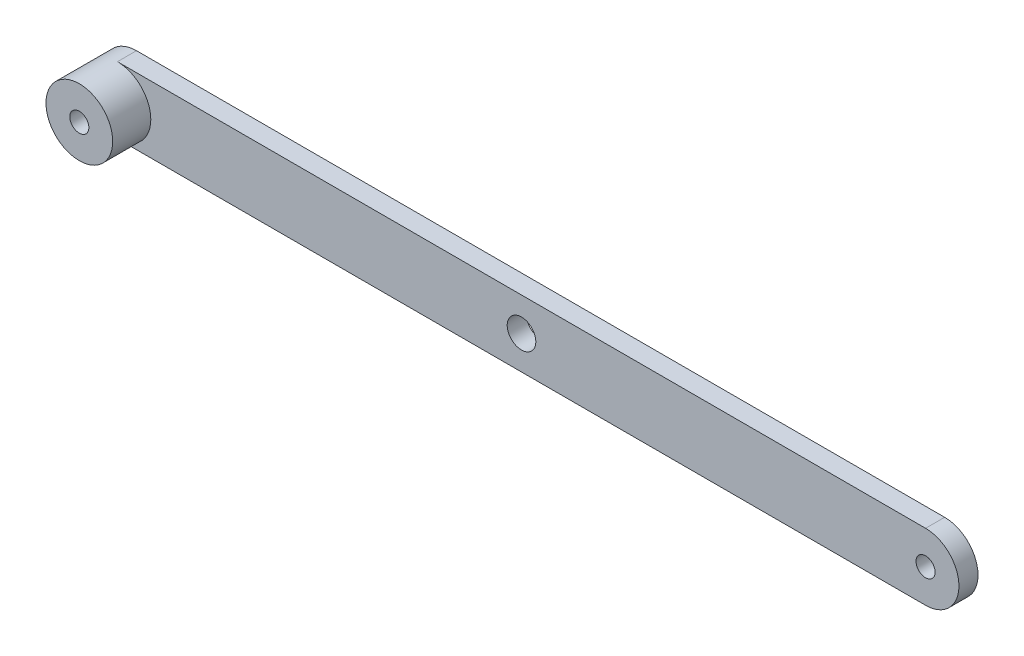
ISO-10303-21;
HEADER;
FILE_DESCRIPTION(('STEP AP214'),'2;1');
FILE_NAME('part.step','',(''),(''),'','','');
FILE_SCHEMA(('AUTOMOTIVE_DESIGN { 1 0 10303 214 1 1 1 1 }'));
ENDSEC;
DATA;
#1=APPLICATION_CONTEXT('core data for automotive mechanical design processes');
#2=APPLICATION_PROTOCOL_DEFINITION('international standard','automotive_design',2000,#1);
#3=PRODUCT_CONTEXT('',#1,'mechanical');
#4=PRODUCT('Part','Part','',(#3));
#5=PRODUCT_RELATED_PRODUCT_CATEGORY('part','',(#4));
#6=PRODUCT_DEFINITION_FORMATION('','',#4);
#7=PRODUCT_DEFINITION_CONTEXT('part definition',#1,'design');
#8=PRODUCT_DEFINITION('design','',#6,#7);
#9=PRODUCT_DEFINITION_SHAPE('','',#8);
#10=(LENGTH_UNIT() NAMED_UNIT(*) SI_UNIT(.MILLI.,.METRE.));
#11=(NAMED_UNIT(*) PLANE_ANGLE_UNIT() SI_UNIT($,.RADIAN.));
#12=(NAMED_UNIT(*) SI_UNIT($,.STERADIAN.) SOLID_ANGLE_UNIT());
#13=UNCERTAINTY_MEASURE_WITH_UNIT(LENGTH_MEASURE(1.E-05),#10,'distance_accuracy_value','');
#14=(GEOMETRIC_REPRESENTATION_CONTEXT(3) GLOBAL_UNCERTAINTY_ASSIGNED_CONTEXT((#13)) GLOBAL_UNIT_ASSIGNED_CONTEXT((#10,
#11,#12)) REPRESENTATION_CONTEXT('',''));
#15=CARTESIAN_POINT('',(0.,0.,0.));
#16=DIRECTION('',(0.,0.,1.));
#17=DIRECTION('',(1.,0.,0.));
#18=AXIS2_PLACEMENT_3D('',#15,#16,#17);
#19=CARTESIAN_POINT('',(-212.,0.,10.));
#20=DIRECTION('',(0.,0.,1.));
#21=DIRECTION('',(1.,0.,0.));
#22=AXIS2_PLACEMENT_3D('',#19,#20,#21);
#23=PLANE('',#22);
#24=CARTESIAN_POINT('',(-212.,0.,10.));
#25=DIRECTION('',(0.,0.,1.));
#26=DIRECTION('',(1.,0.,0.));
#27=AXIS2_PLACEMENT_3D('',#24,#25,#26);
#28=CIRCLE('',#27,17.5);
#29=CARTESIAN_POINT('',(-212.,-17.5,10.));
#30=VERTEX_POINT('',#29);
#31=CARTESIAN_POINT('',(-212.,17.5,10.));
#32=VERTEX_POINT('',#31);
#33=EDGE_CURVE('E11',#30,#32,#28,.T.);
#34=ORIENTED_EDGE('',*,*,#33,.F.);
#35=DIRECTION('',(1.,0.,0.));
#36=VECTOR('',#35,1.);
#37=CARTESIAN_POINT('',(-212.,-17.5,10.));
#38=LINE('',#37,#36);
#39=CARTESIAN_POINT('',(212.,-17.5,10.));
#40=VERTEX_POINT('',#39);
#41=EDGE_CURVE('E113',#30,#40,#38,.T.);
#42=ORIENTED_EDGE('',*,*,#41,.T.);
#43=CARTESIAN_POINT('',(212.,0.,10.));
#44=DIRECTION('',(0.,0.,1.));
#45=DIRECTION('',(1.,0.,0.));
#46=AXIS2_PLACEMENT_3D('',#43,#44,#45);
#47=CIRCLE('',#46,17.5);
#48=CARTESIAN_POINT('',(212.,17.5,10.));
#49=VERTEX_POINT('',#48);
#50=EDGE_CURVE('E58',#40,#49,#47,.T.);
#51=ORIENTED_EDGE('',*,*,#50,.T.);
#52=DIRECTION('',(-1.,0.,0.));
#53=VECTOR('',#52,1.);
#54=CARTESIAN_POINT('',(-212.,17.5,10.));
#55=LINE('',#54,#53);
#56=EDGE_CURVE('E89',#49,#32,#55,.T.);
#57=ORIENTED_EDGE('',*,*,#56,.T.);
#58=EDGE_LOOP('',(#34,#42,#51,#57));
#59=FACE_BOUND('',#58,.T.);
#60=CARTESIAN_POINT('',(212.,0.,10.));
#61=DIRECTION('',(0.,0.,1.));
#62=DIRECTION('',(1.,0.,0.));
#63=AXIS2_PLACEMENT_3D('',#60,#61,#62);
#64=CIRCLE('',#63,5.00000000000002);
#65=CARTESIAN_POINT('',(217.,0.,10.));
#66=VERTEX_POINT('',#65);
#67=EDGE_CURVE('E129',#66,#66,#64,.T.);
#68=ORIENTED_EDGE('',*,*,#67,.F.);
#69=EDGE_LOOP('',(#68));
#70=FACE_BOUND('',#69,.T.);
#71=CARTESIAN_POINT('',(0.,0.,10.));
#72=DIRECTION('',(0.,0.,1.));
#73=DIRECTION('',(1.,0.,0.));
#74=AXIS2_PLACEMENT_3D('',#71,#72,#73);
#75=CIRCLE('',#74,7.5);
#76=CARTESIAN_POINT('',(7.5,0.,10.));
#77=VERTEX_POINT('',#76);
#78=EDGE_CURVE('E134',#77,#77,#75,.T.);
#79=ORIENTED_EDGE('',*,*,#78,.F.);
#80=EDGE_LOOP('',(#79));
#81=FACE_BOUND('',#80,.T.);
#82=ADVANCED_FACE('F39',(#59,#70,#81),#23,.T.);
#83=CARTESIAN_POINT('',(-212.,0.,0.));
#84=DIRECTION('',(0.,0.,1.));
#85=DIRECTION('',(1.,0.,0.));
#86=AXIS2_PLACEMENT_3D('',#83,#84,#85);
#87=PLANE('',#86);
#88=CARTESIAN_POINT('',(-212.,0.,0.));
#89=DIRECTION('',(0.,0.,1.));
#90=DIRECTION('',(1.,0.,0.));
#91=AXIS2_PLACEMENT_3D('',#88,#89,#90);
#92=CIRCLE('',#91,17.5);
#93=CARTESIAN_POINT('',(-212.,17.5,0.));
#94=VERTEX_POINT('',#93);
#95=CARTESIAN_POINT('',(-212.,-17.5,0.));
#96=VERTEX_POINT('',#95);
#97=EDGE_CURVE('E102',#94,#96,#92,.T.);
#98=ORIENTED_EDGE('',*,*,#97,.F.);
#99=DIRECTION('',(-1.,0.,0.));
#100=VECTOR('',#99,1.);
#101=CARTESIAN_POINT('',(-212.,17.5,0.));
#102=LINE('',#101,#100);
#103=CARTESIAN_POINT('',(212.,17.5,0.));
#104=VERTEX_POINT('',#103);
#105=EDGE_CURVE('E81',#104,#94,#102,.T.);
#106=ORIENTED_EDGE('',*,*,#105,.F.);
#107=CARTESIAN_POINT('',(212.,0.,0.));
#108=DIRECTION('',(0.,0.,1.));
#109=DIRECTION('',(1.,0.,0.));
#110=AXIS2_PLACEMENT_3D('',#107,#108,#109);
#111=CIRCLE('',#110,17.5);
#112=CARTESIAN_POINT('',(212.,-17.5,0.));
#113=VERTEX_POINT('',#112);
#114=EDGE_CURVE('E75',#113,#104,#111,.T.);
#115=ORIENTED_EDGE('',*,*,#114,.F.);
#116=DIRECTION('',(1.,0.,0.));
#117=VECTOR('',#116,1.);
#118=CARTESIAN_POINT('',(-212.,-17.5,0.));
#119=LINE('',#118,#117);
#120=EDGE_CURVE('E116',#96,#113,#119,.T.);
#121=ORIENTED_EDGE('',*,*,#120,.F.);
#122=EDGE_LOOP('',(#98,#106,#115,#121));
#123=FACE_BOUND('',#122,.T.);
#124=CARTESIAN_POINT('',(-212.,0.,0.));
#125=DIRECTION('',(0.,0.,1.));
#126=DIRECTION('',(1.,0.,0.));
#127=AXIS2_PLACEMENT_3D('',#124,#125,#126);
#128=CIRCLE('',#127,5.00000000000002);
#129=CARTESIAN_POINT('',(-207.,0.,0.));
#130=VERTEX_POINT('',#129);
#131=EDGE_CURVE('E120',#130,#130,#128,.T.);
#132=ORIENTED_EDGE('',*,*,#131,.T.);
#133=EDGE_LOOP('',(#132));
#134=FACE_BOUND('',#133,.T.);
#135=CARTESIAN_POINT('',(212.,0.,0.));
#136=DIRECTION('',(0.,0.,1.));
#137=DIRECTION('',(1.,0.,0.));
#138=AXIS2_PLACEMENT_3D('',#135,#136,#137);
#139=CIRCLE('',#138,5.00000000000002);
#140=CARTESIAN_POINT('',(217.,0.,0.));
#141=VERTEX_POINT('',#140);
#142=EDGE_CURVE('E130',#141,#141,#139,.T.);
#143=ORIENTED_EDGE('',*,*,#142,.T.);
#144=EDGE_LOOP('',(#143));
#145=FACE_BOUND('',#144,.T.);
#146=CARTESIAN_POINT('',(0.,0.,0.));
#147=DIRECTION('',(0.,0.,1.));
#148=DIRECTION('',(1.,0.,0.));
#149=AXIS2_PLACEMENT_3D('',#146,#147,#148);
#150=CIRCLE('',#149,7.5);
#151=CARTESIAN_POINT('',(7.5,0.,0.));
#152=VERTEX_POINT('',#151);
#153=EDGE_CURVE('E138',#152,#152,#150,.T.);
#154=ORIENTED_EDGE('',*,*,#153,.T.);
#155=EDGE_LOOP('',(#154));
#156=FACE_BOUND('',#155,.T.);
#157=ADVANCED_FACE('F168',(#123,#134,#145,#156),#87,.F.);
#158=CARTESIAN_POINT('',(-212.,0.,10.));
#159=DIRECTION('',(0.,0.,-1.));
#160=DIRECTION('',(-1.,0.,0.));
#161=AXIS2_PLACEMENT_3D('',#158,#159,#160);
#162=CYLINDRICAL_SURFACE('',#161,17.5);
#163=ORIENTED_EDGE('',*,*,#97,.T.);
#164=DIRECTION('',(0.,0.,-1.));
#165=VECTOR('',#164,1.);
#166=CARTESIAN_POINT('',(-212.,-17.5,10.));
#167=LINE('',#166,#165);
#168=EDGE_CURVE('E43',#30,#96,#167,.T.);
#169=ORIENTED_EDGE('',*,*,#168,.F.);
#170=ORIENTED_EDGE('',*,*,#33,.T.);
#171=DIRECTION('',(0.,0.,-1.));
#172=VECTOR('',#171,1.);
#173=CARTESIAN_POINT('',(-212.,17.5,10.));
#174=LINE('',#173,#172);
#175=EDGE_CURVE('E87',#32,#94,#174,.T.);
#176=ORIENTED_EDGE('',*,*,#175,.T.);
#177=EDGE_LOOP('',(#163,#169,#170,#176));
#178=FACE_BOUND('',#177,.T.);
#179=CARTESIAN_POINT('',(-212.,0.,30.));
#180=DIRECTION('',(0.,0.,1.));
#181=DIRECTION('',(1.,0.,0.));
#182=AXIS2_PLACEMENT_3D('',#179,#180,#181);
#183=CIRCLE('',#182,17.5);
#184=CARTESIAN_POINT('',(-194.5,0.,30.));
#185=VERTEX_POINT('',#184);
#186=EDGE_CURVE('E142',#185,#185,#183,.T.);
#187=ORIENTED_EDGE('',*,*,#186,.F.);
#188=EDGE_LOOP('',(#187));
#189=FACE_BOUND('',#188,.T.);
#190=ADVANCED_FACE('F41',(#178,#189),#162,.T.);
#191=CARTESIAN_POINT('',(-212.,-17.5,10.));
#192=DIRECTION('',(0.,1.,0.));
#193=DIRECTION('',(0.,0.,1.));
#194=AXIS2_PLACEMENT_3D('',#191,#192,#193);
#195=PLANE('',#194);
#196=ORIENTED_EDGE('',*,*,#120,.T.);
#197=DIRECTION('',(0.,0.,-1.));
#198=VECTOR('',#197,1.);
#199=CARTESIAN_POINT('',(212.,-17.5,10.));
#200=LINE('',#199,#198);
#201=EDGE_CURVE('E105',#40,#113,#200,.T.);
#202=ORIENTED_EDGE('',*,*,#201,.F.);
#203=ORIENTED_EDGE('',*,*,#41,.F.);
#204=ORIENTED_EDGE('',*,*,#168,.T.);
#205=EDGE_LOOP('',(#196,#202,#203,#204));
#206=FACE_BOUND('',#205,.T.);
#207=ADVANCED_FACE('F182',(#206),#195,.F.);
#208=CARTESIAN_POINT('',(212.,0.,10.));
#209=DIRECTION('',(0.,0.,-1.));
#210=DIRECTION('',(-1.,0.,0.));
#211=AXIS2_PLACEMENT_3D('',#208,#209,#210);
#212=CYLINDRICAL_SURFACE('',#211,17.5);
#213=ORIENTED_EDGE('',*,*,#114,.T.);
#214=DIRECTION('',(0.,0.,-1.));
#215=VECTOR('',#214,1.);
#216=CARTESIAN_POINT('',(212.,17.5,10.));
#217=LINE('',#216,#215);
#218=EDGE_CURVE('E94',#49,#104,#217,.T.);
#219=ORIENTED_EDGE('',*,*,#218,.F.);
#220=ORIENTED_EDGE('',*,*,#50,.F.);
#221=ORIENTED_EDGE('',*,*,#201,.T.);
#222=EDGE_LOOP('',(#213,#219,#220,#221));
#223=FACE_BOUND('',#222,.T.);
#224=ADVANCED_FACE('F180',(#223),#212,.T.);
#225=CARTESIAN_POINT('',(-212.,17.5,10.));
#226=DIRECTION('',(0.,-1.,0.));
#227=DIRECTION('',(0.,0.,-1.));
#228=AXIS2_PLACEMENT_3D('',#225,#226,#227);
#229=PLANE('',#228);
#230=ORIENTED_EDGE('',*,*,#105,.T.);
#231=ORIENTED_EDGE('',*,*,#175,.F.);
#232=ORIENTED_EDGE('',*,*,#56,.F.);
#233=ORIENTED_EDGE('',*,*,#218,.T.);
#234=EDGE_LOOP('',(#230,#231,#232,#233));
#235=FACE_BOUND('',#234,.T.);
#236=ADVANCED_FACE('F88',(#235),#229,.F.);
#237=CARTESIAN_POINT('',(-212.,0.,10.));
#238=DIRECTION('',(0.,0.,-1.));
#239=DIRECTION('',(-1.,0.,0.));
#240=AXIS2_PLACEMENT_3D('',#237,#238,#239);
#241=CYLINDRICAL_SURFACE('',#240,5.00000000000002);
#242=ORIENTED_EDGE('',*,*,#131,.F.);
#243=EDGE_LOOP('',(#242));
#244=FACE_BOUND('',#243,.T.);
#245=CARTESIAN_POINT('',(-212.,0.,30.));
#246=DIRECTION('',(0.,0.,1.));
#247=DIRECTION('',(1.,0.,0.));
#248=AXIS2_PLACEMENT_3D('',#245,#246,#247);
#249=CIRCLE('',#248,4.99999999999999);
#250=CARTESIAN_POINT('',(-207.,0.,30.));
#251=VERTEX_POINT('',#250);
#252=EDGE_CURVE('E149',#251,#251,#249,.T.);
#253=ORIENTED_EDGE('',*,*,#252,.T.);
#254=EDGE_LOOP('',(#253));
#255=FACE_BOUND('',#254,.T.);
#256=ADVANCED_FACE('F154',(#244,#255),#241,.F.);
#257=CARTESIAN_POINT('',(212.,0.,10.));
#258=DIRECTION('',(0.,0.,-1.));
#259=DIRECTION('',(-1.,0.,0.));
#260=AXIS2_PLACEMENT_3D('',#257,#258,#259);
#261=CYLINDRICAL_SURFACE('',#260,5.00000000000002);
#262=ORIENTED_EDGE('',*,*,#67,.T.);
#263=EDGE_LOOP('',(#262));
#264=FACE_BOUND('',#263,.T.);
#265=ORIENTED_EDGE('',*,*,#142,.F.);
#266=EDGE_LOOP('',(#265));
#267=FACE_BOUND('',#266,.T.);
#268=ADVANCED_FACE('F164',(#264,#267),#261,.F.);
#269=CARTESIAN_POINT('',(0.,0.,10.));
#270=DIRECTION('',(0.,0.,-1.));
#271=DIRECTION('',(-1.,0.,0.));
#272=AXIS2_PLACEMENT_3D('',#269,#270,#271);
#273=CYLINDRICAL_SURFACE('',#272,7.5);
#274=ORIENTED_EDGE('',*,*,#78,.T.);
#275=EDGE_LOOP('',(#274));
#276=FACE_BOUND('',#275,.T.);
#277=ORIENTED_EDGE('',*,*,#153,.F.);
#278=EDGE_LOOP('',(#277));
#279=FACE_BOUND('',#278,.T.);
#280=ADVANCED_FACE('F158',(#276,#279),#273,.F.);
#281=CARTESIAN_POINT('',(-212.,0.,30.));
#282=DIRECTION('',(0.,0.,1.));
#283=DIRECTION('',(1.,0.,0.));
#284=AXIS2_PLACEMENT_3D('',#281,#282,#283);
#285=PLANE('',#284);
#286=ORIENTED_EDGE('',*,*,#186,.T.);
#287=EDGE_LOOP('',(#286));
#288=FACE_BOUND('',#287,.T.);
#289=ORIENTED_EDGE('',*,*,#252,.F.);
#290=EDGE_LOOP('',(#289));
#291=FACE_BOUND('',#290,.T.);
#292=ADVANCED_FACE('F156',(#288,#291),#285,.T.);
#293=CLOSED_SHELL('',(#82,#157,#190,#207,#224,#236,#256,#268,#280,#292));
#294=MANIFOLD_SOLID_BREP('B2',#293);
#295=ADVANCED_BREP_SHAPE_REPRESENTATION('',(#18,#294),#14);
#296=SHAPE_DEFINITION_REPRESENTATION(#9,#295);
ENDSEC;
END-ISO-10303-21;
